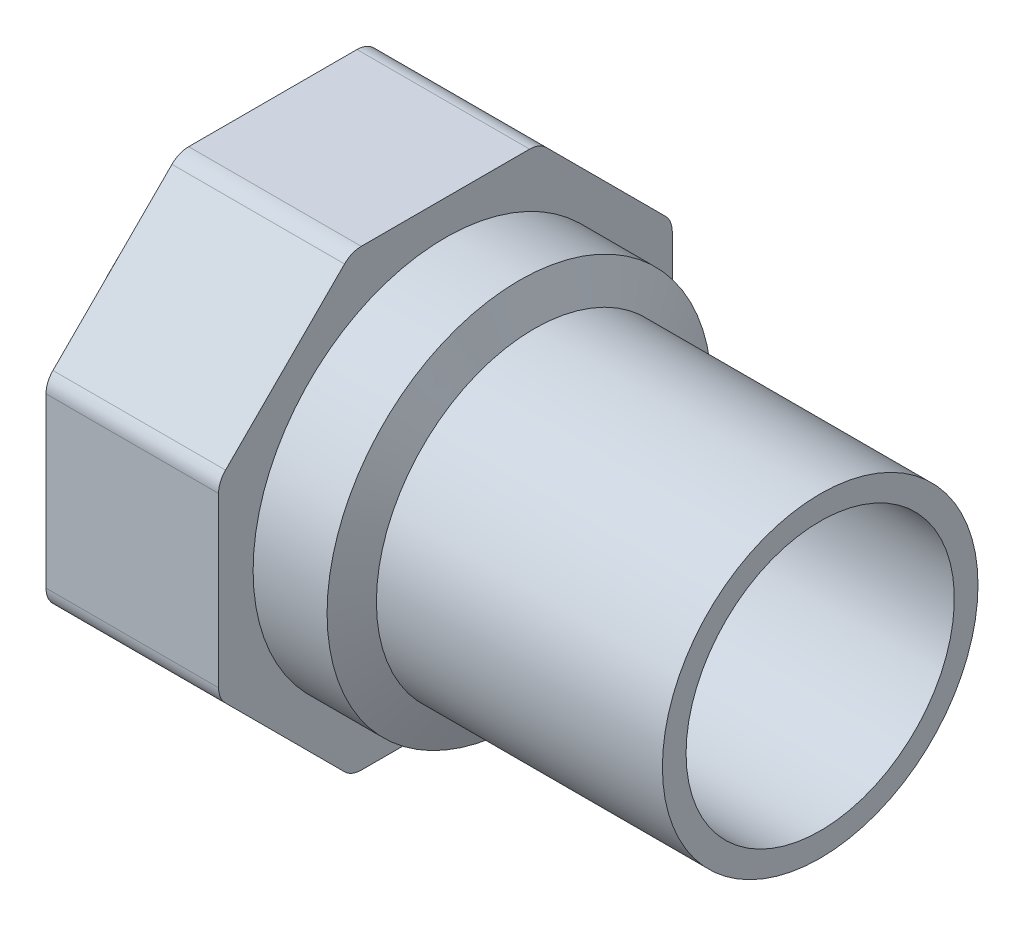
ISO-10303-21;
HEADER;
FILE_DESCRIPTION(('STEP AP214'),'2;1');
FILE_NAME('part.step','',(''),(''),'','','');
FILE_SCHEMA(('AUTOMOTIVE_DESIGN { 1 0 10303 214 1 1 1 1 }'));
ENDSEC;
DATA;
#1=APPLICATION_CONTEXT('core data for automotive mechanical design processes');
#2=APPLICATION_PROTOCOL_DEFINITION('international standard','automotive_design',2000,#1);
#3=PRODUCT_CONTEXT('',#1,'mechanical');
#4=PRODUCT('Part','Part','',(#3));
#5=PRODUCT_RELATED_PRODUCT_CATEGORY('part','',(#4));
#6=PRODUCT_DEFINITION_FORMATION('','',#4);
#7=PRODUCT_DEFINITION_CONTEXT('part definition',#1,'design');
#8=PRODUCT_DEFINITION('design','',#6,#7);
#9=PRODUCT_DEFINITION_SHAPE('','',#8);
#10=(LENGTH_UNIT() NAMED_UNIT(*) SI_UNIT(.MILLI.,.METRE.));
#11=(NAMED_UNIT(*) PLANE_ANGLE_UNIT() SI_UNIT($,.RADIAN.));
#12=(NAMED_UNIT(*) SI_UNIT($,.STERADIAN.) SOLID_ANGLE_UNIT());
#13=UNCERTAINTY_MEASURE_WITH_UNIT(LENGTH_MEASURE(1.E-05),#10,'distance_accuracy_value','');
#14=(GEOMETRIC_REPRESENTATION_CONTEXT(3) GLOBAL_UNCERTAINTY_ASSIGNED_CONTEXT((#13)) GLOBAL_UNIT_ASSIGNED_CONTEXT((#10,
#11,#12)) REPRESENTATION_CONTEXT('',''));
#15=CARTESIAN_POINT('',(0.,0.,0.));
#16=DIRECTION('',(0.,0.,1.));
#17=DIRECTION('',(1.,0.,0.));
#18=AXIS2_PLACEMENT_3D('',#15,#16,#17);
#19=CARTESIAN_POINT('',(-29.,0.,0.));
#20=DIRECTION('',(-1.,0.,0.));
#21=DIRECTION('',(0.,0.,1.));
#22=AXIS2_PLACEMENT_3D('',#19,#20,#21);
#23=CYLINDRICAL_SURFACE('',#22,16.);
#24=CARTESIAN_POINT('',(-29.,0.,0.));
#25=DIRECTION('',(1.,0.,0.));
#26=DIRECTION('',(0.,1.,0.));
#27=AXIS2_PLACEMENT_3D('',#24,#25,#26);
#28=CIRCLE('',#27,16.);
#29=CARTESIAN_POINT('',(-29.,16.,0.));
#30=VERTEX_POINT('',#29);
#31=EDGE_CURVE('E193',#30,#30,#28,.F.);
#32=ORIENTED_EDGE('',*,*,#31,.F.);
#33=EDGE_LOOP('',(#32));
#34=FACE_BOUND('',#33,.T.);
#35=CARTESIAN_POINT('',(0.,0.,0.));
#36=DIRECTION('',(-1.,0.,0.));
#37=DIRECTION('',(0.,0.,1.));
#38=AXIS2_PLACEMENT_3D('',#35,#36,#37);
#39=CIRCLE('',#38,16.);
#40=CARTESIAN_POINT('',(0.,0.,16.));
#41=VERTEX_POINT('',#40);
#42=EDGE_CURVE('E18',#41,#41,#39,.F.);
#43=ORIENTED_EDGE('',*,*,#42,.F.);
#44=EDGE_LOOP('',(#43));
#45=FACE_BOUND('',#44,.T.);
#46=ADVANCED_FACE('F15',(#34,#45),#23,.T.);
#47=CARTESIAN_POINT('',(-29.,0.,0.));
#48=DIRECTION('',(-1.,0.,0.));
#49=DIRECTION('',(0.,0.,1.));
#50=AXIS2_PLACEMENT_3D('',#47,#48,#49);
#51=CONICAL_SURFACE('',#50,16.,1.16590454050981);
#52=CARTESIAN_POINT('',(-30.5,0.,0.));
#53=DIRECTION('',(-1.,0.,0.));
#54=DIRECTION('',(0.,1.,0.));
#55=AXIS2_PLACEMENT_3D('',#52,#53,#54);
#56=CIRCLE('',#55,19.5);
#57=CARTESIAN_POINT('',(-30.5,19.5,0.));
#58=VERTEX_POINT('',#57);
#59=EDGE_CURVE('E189',#58,#58,#56,.T.);
#60=ORIENTED_EDGE('',*,*,#59,.F.);
#61=EDGE_LOOP('',(#60));
#62=FACE_BOUND('',#61,.T.);
#63=ORIENTED_EDGE('',*,*,#31,.T.);
#64=EDGE_LOOP('',(#63));
#65=FACE_BOUND('',#64,.T.);
#66=ADVANCED_FACE('F268',(#62,#65),#51,.T.);
#67=CARTESIAN_POINT('',(0.,16.,16.1920021082986));
#68=DIRECTION('',(1.,0.,0.));
#69=DIRECTION('',(0.,-1.,0.));
#70=AXIS2_PLACEMENT_3D('',#67,#68,#69);
#71=PLANE('',#70);
#72=CARTESIAN_POINT('',(0.,0.,0.));
#73=DIRECTION('',(-1.,0.,0.));
#74=DIRECTION('',(0.,0.,1.));
#75=AXIS2_PLACEMENT_3D('',#72,#73,#74);
#76=CIRCLE('',#75,13.6);
#77=CARTESIAN_POINT('',(0.,0.,13.6));
#78=VERTEX_POINT('',#77);
#79=EDGE_CURVE('E192',#78,#78,#76,.F.);
#80=ORIENTED_EDGE('',*,*,#79,.F.);
#81=EDGE_LOOP('',(#80));
#82=FACE_BOUND('',#81,.T.);
#83=ORIENTED_EDGE('',*,*,#42,.T.);
#84=EDGE_LOOP('',(#83));
#85=FACE_BOUND('',#84,.T.);
#86=ADVANCED_FACE('F264',(#82,#85),#71,.T.);
#87=CARTESIAN_POINT('',(-38.,0.,0.));
#88=DIRECTION('',(-1.,0.,0.));
#89=DIRECTION('',(0.,0.,1.));
#90=AXIS2_PLACEMENT_3D('',#87,#88,#89);
#91=CYLINDRICAL_SURFACE('',#90,19.5);
#92=CARTESIAN_POINT('',(-38.,0.,0.));
#93=DIRECTION('',(-1.,0.,0.));
#94=DIRECTION('',(0.,0.,1.));
#95=AXIS2_PLACEMENT_3D('',#92,#93,#94);
#96=CIRCLE('',#95,19.5);
#97=CARTESIAN_POINT('',(-38.,0.,19.5));
#98=VERTEX_POINT('',#97);
#99=EDGE_CURVE('E188',#98,#98,#96,.T.);
#100=ORIENTED_EDGE('',*,*,#99,.F.);
#101=EDGE_LOOP('',(#100));
#102=FACE_BOUND('',#101,.T.);
#103=ORIENTED_EDGE('',*,*,#59,.T.);
#104=EDGE_LOOP('',(#103));
#105=FACE_BOUND('',#104,.T.);
#106=ADVANCED_FACE('F267',(#102,#105),#91,.T.);
#107=CARTESIAN_POINT('',(0.,0.,0.));
#108=DIRECTION('',(-1.,0.,0.));
#109=DIRECTION('',(0.,0.,1.));
#110=AXIS2_PLACEMENT_3D('',#107,#108,#109);
#111=CYLINDRICAL_SURFACE('',#110,13.6);
#112=ORIENTED_EDGE('',*,*,#79,.T.);
#113=EDGE_LOOP('',(#112));
#114=FACE_BOUND('',#113,.T.);
#115=CARTESIAN_POINT('',(-37.7775828648937,0.,0.));
#116=DIRECTION('',(1.,0.,0.));
#117=DIRECTION('',(0.,1.,0.));
#118=AXIS2_PLACEMENT_3D('',#115,#116,#117);
#119=CIRCLE('',#118,13.6);
#120=CARTESIAN_POINT('',(-37.7775828648937,13.6,0.));
#121=VERTEX_POINT('',#120);
#122=EDGE_CURVE('E135',#121,#121,#119,.T.);
#123=ORIENTED_EDGE('',*,*,#122,.F.);
#124=EDGE_LOOP('',(#123));
#125=FACE_BOUND('',#124,.T.);
#126=ADVANCED_FACE('F261',(#114,#125),#111,.F.);
#127=CARTESIAN_POINT('',(-38.,23.,23.));
#128=DIRECTION('',(1.,0.,0.));
#129=DIRECTION('',(0.,-1.,0.));
#130=AXIS2_PLACEMENT_3D('',#127,#128,#129);
#131=PLANE('',#130);
#132=ORIENTED_EDGE('',*,*,#99,.T.);
#133=EDGE_LOOP('',(#132));
#134=FACE_BOUND('',#133,.T.);
#135=CARTESIAN_POINT('',(-38.,8.53279938488576,20.6));
#136=DIRECTION('',(1.,0.,0.));
#137=DIRECTION('',(0.,0.,-1.));
#138=AXIS2_PLACEMENT_3D('',#135,#136,#137);
#139=CIRCLE('',#138,2.39999999999998);
#140=CARTESIAN_POINT('',(-38.,8.53279938488576,23.));
#141=VERTEX_POINT('',#140);
#142=CARTESIAN_POINT('',(-38.,10.2298556597335,22.2970562748477));
#143=VERTEX_POINT('',#142);
#144=EDGE_CURVE('E254',#141,#143,#139,.F.);
#145=ORIENTED_EDGE('',*,*,#144,.F.);
#146=DIRECTION('',(0.,1.,0.));
#147=VECTOR('',#146,1.);
#148=CARTESIAN_POINT('',(-38.,0.,23.));
#149=LINE('',#148,#147);
#150=CARTESIAN_POINT('',(-38.,-8.53279938488579,23.));
#151=VERTEX_POINT('',#150);
#152=EDGE_CURVE('E132',#151,#141,#149,.T.);
#153=ORIENTED_EDGE('',*,*,#152,.F.);
#154=CARTESIAN_POINT('',(-38.,-8.5327993848858,20.6));
#155=DIRECTION('',(1.,0.,0.));
#156=DIRECTION('',(0.,0.,-1.));
#157=AXIS2_PLACEMENT_3D('',#154,#155,#156);
#158=CIRCLE('',#157,2.39999999999996);
#159=CARTESIAN_POINT('',(-38.,-10.2298556597335,22.2970562748477));
#160=VERTEX_POINT('',#159);
#161=EDGE_CURVE('E126',#160,#151,#158,.F.);
#162=ORIENTED_EDGE('',*,*,#161,.F.);
#163=DIRECTION('',(0.,0.707106781186547,0.707106781186548));
#164=VECTOR('',#163,1.);
#165=CARTESIAN_POINT('',(-38.,-16.2634559672906,16.2634559672906));
#166=LINE('',#165,#164);
#167=CARTESIAN_POINT('',(-38.,-22.2970562748477,10.2298556597335));
#168=VERTEX_POINT('',#167);
#169=EDGE_CURVE('E130',#168,#160,#166,.T.);
#170=ORIENTED_EDGE('',*,*,#169,.F.);
#171=CARTESIAN_POINT('',(-38.,-20.6,8.53279938488576));
#172=DIRECTION('',(1.,0.,0.));
#173=DIRECTION('',(0.,0.,-1.));
#174=AXIS2_PLACEMENT_3D('',#171,#172,#173);
#175=CIRCLE('',#174,2.39999999999998);
#176=CARTESIAN_POINT('',(-38.,-23.,8.53279938488576));
#177=VERTEX_POINT('',#176);
#178=EDGE_CURVE('E149',#177,#168,#175,.F.);
#179=ORIENTED_EDGE('',*,*,#178,.F.);
#180=DIRECTION('',(0.,0.,1.));
#181=VECTOR('',#180,1.);
#182=CARTESIAN_POINT('',(-38.,-23.,0.));
#183=LINE('',#182,#181);
#184=CARTESIAN_POINT('',(-38.,-23.,-8.53279938488577));
#185=VERTEX_POINT('',#184);
#186=EDGE_CURVE('E154',#185,#177,#183,.T.);
#187=ORIENTED_EDGE('',*,*,#186,.F.);
#188=CARTESIAN_POINT('',(-38.,-20.6,-8.53279938488577));
#189=DIRECTION('',(1.,0.,0.));
#190=DIRECTION('',(0.,0.,-1.));
#191=AXIS2_PLACEMENT_3D('',#188,#189,#190);
#192=CIRCLE('',#191,2.39999999999998);
#193=CARTESIAN_POINT('',(-38.,-22.2970562748477,-10.2298556597335));
#194=VERTEX_POINT('',#193);
#195=EDGE_CURVE('E239',#194,#185,#192,.F.);
#196=ORIENTED_EDGE('',*,*,#195,.F.);
#197=DIRECTION('',(0.,-0.707106781186548,0.707106781186547));
#198=VECTOR('',#197,1.);
#199=CARTESIAN_POINT('',(-38.,-16.2634559672906,-16.2634559672906));
#200=LINE('',#199,#198);
#201=CARTESIAN_POINT('',(-38.,-10.2298556597335,-22.2970562748477));
#202=VERTEX_POINT('',#201);
#203=EDGE_CURVE('E159',#202,#194,#200,.T.);
#204=ORIENTED_EDGE('',*,*,#203,.F.);
#205=CARTESIAN_POINT('',(-38.,-8.53279938488576,-20.6));
#206=DIRECTION('',(1.,0.,0.));
#207=DIRECTION('',(0.,0.,-1.));
#208=AXIS2_PLACEMENT_3D('',#205,#206,#207);
#209=CIRCLE('',#208,2.39999999999998);
#210=CARTESIAN_POINT('',(-38.,-8.53279938488575,-23.));
#211=VERTEX_POINT('',#210);
#212=EDGE_CURVE('E242',#211,#202,#209,.F.);
#213=ORIENTED_EDGE('',*,*,#212,.F.);
#214=DIRECTION('',(0.,-1.,0.));
#215=VECTOR('',#214,1.);
#216=CARTESIAN_POINT('',(-38.,0.,-23.));
#217=LINE('',#216,#215);
#218=CARTESIAN_POINT('',(-38.,8.53279938488578,-23.));
#219=VERTEX_POINT('',#218);
#220=EDGE_CURVE('E164',#219,#211,#217,.T.);
#221=ORIENTED_EDGE('',*,*,#220,.F.);
#222=CARTESIAN_POINT('',(-38.,8.53279938488578,-20.6));
#223=DIRECTION('',(1.,0.,0.));
#224=DIRECTION('',(0.,0.,-1.));
#225=AXIS2_PLACEMENT_3D('',#222,#223,#224);
#226=CIRCLE('',#225,2.39999999999996);
#227=CARTESIAN_POINT('',(-38.,10.2298556597335,-22.2970562748477));
#228=VERTEX_POINT('',#227);
#229=EDGE_CURVE('E245',#228,#219,#226,.F.);
#230=ORIENTED_EDGE('',*,*,#229,.F.);
#231=DIRECTION('',(0.,-0.707106781186547,-0.707106781186547));
#232=VECTOR('',#231,1.);
#233=CARTESIAN_POINT('',(-38.,16.2634559672906,-16.2634559672906));
#234=LINE('',#233,#232);
#235=CARTESIAN_POINT('',(-38.,22.2970562748477,-10.2298556597335));
#236=VERTEX_POINT('',#235);
#237=EDGE_CURVE('E169',#236,#228,#234,.T.);
#238=ORIENTED_EDGE('',*,*,#237,.F.);
#239=CARTESIAN_POINT('',(-38.,20.6,-8.53279938488577));
#240=DIRECTION('',(1.,0.,0.));
#241=DIRECTION('',(0.,0.,-1.));
#242=AXIS2_PLACEMENT_3D('',#239,#240,#241);
#243=CIRCLE('',#242,2.39999999999997);
#244=CARTESIAN_POINT('',(-38.,23.,-8.53279938488576));
#245=VERTEX_POINT('',#244);
#246=EDGE_CURVE('E248',#245,#236,#243,.F.);
#247=ORIENTED_EDGE('',*,*,#246,.F.);
#248=DIRECTION('',(0.,0.,-1.));
#249=VECTOR('',#248,1.);
#250=CARTESIAN_POINT('',(-38.,23.,0.));
#251=LINE('',#250,#249);
#252=CARTESIAN_POINT('',(-38.,23.,8.53279938488576));
#253=VERTEX_POINT('',#252);
#254=EDGE_CURVE('E174',#253,#245,#251,.T.);
#255=ORIENTED_EDGE('',*,*,#254,.F.);
#256=CARTESIAN_POINT('',(-38.,20.6,8.53279938488576));
#257=DIRECTION('',(1.,0.,0.));
#258=DIRECTION('',(0.,0.,-1.));
#259=AXIS2_PLACEMENT_3D('',#256,#257,#258);
#260=CIRCLE('',#259,2.4);
#261=CARTESIAN_POINT('',(-38.,22.2970562748477,10.2298556597335));
#262=VERTEX_POINT('',#261);
#263=EDGE_CURVE('E251',#262,#253,#260,.F.);
#264=ORIENTED_EDGE('',*,*,#263,.F.);
#265=DIRECTION('',(0.,0.707106781186547,-0.707106781186547));
#266=VECTOR('',#265,1.);
#267=CARTESIAN_POINT('',(-38.,16.2634559672906,16.2634559672906));
#268=LINE('',#267,#266);
#269=EDGE_CURVE('E179',#143,#262,#268,.T.);
#270=ORIENTED_EDGE('',*,*,#269,.F.);
#271=EDGE_LOOP('',(#145,#153,#162,#170,#179,#187,#196,#204,#213,#221,#230,#238,#247,#255,#264,#270));
#272=FACE_BOUND('',#271,.T.);
#273=ADVANCED_FACE('F128',(#134,#272),#131,.T.);
#274=CARTESIAN_POINT('',(-38.,0.,0.));
#275=DIRECTION('',(-1.,0.,0.));
#276=DIRECTION('',(0.,0.,1.));
#277=AXIS2_PLACEMENT_3D('',#274,#275,#276);
#278=CONICAL_SURFACE('',#277,13.9852377784781,1.0471975511966);
#279=ORIENTED_EDGE('',*,*,#122,.T.);
#280=EDGE_LOOP('',(#279));
#281=FACE_BOUND('',#280,.T.);
#282=CARTESIAN_POINT('',(-38.,0.,0.));
#283=DIRECTION('',(1.,0.,0.));
#284=DIRECTION('',(0.,1.,0.));
#285=AXIS2_PLACEMENT_3D('',#282,#283,#284);
#286=CIRCLE('',#285,13.9852377784781);
#287=CARTESIAN_POINT('',(-38.,13.9852377784781,0.));
#288=VERTEX_POINT('',#287);
#289=EDGE_CURVE('E153',#288,#288,#286,.T.);
#290=ORIENTED_EDGE('',*,*,#289,.F.);
#291=EDGE_LOOP('',(#290));
#292=FACE_BOUND('',#291,.T.);
#293=ADVANCED_FACE('F438',(#281,#292),#278,.F.);
#294=CARTESIAN_POINT('',(-38.,-8.5327993848858,20.6));
#295=DIRECTION('',(1.,0.,0.));
#296=DIRECTION('',(0.,0.,-1.));
#297=AXIS2_PLACEMENT_3D('',#294,#295,#296);
#298=CYLINDRICAL_SURFACE('',#297,2.39999999999996);
#299=CARTESIAN_POINT('',(-55.5,-8.5327993848858,20.6));
#300=DIRECTION('',(1.,0.,0.));
#301=DIRECTION('',(0.,0.,-1.));
#302=AXIS2_PLACEMENT_3D('',#299,#300,#301);
#303=CIRCLE('',#302,2.39999999999996);
#304=CARTESIAN_POINT('',(-55.5,-10.2298556597335,22.2970562748477));
#305=VERTEX_POINT('',#304);
#306=CARTESIAN_POINT('',(-55.5,-8.53279938488579,23.));
#307=VERTEX_POINT('',#306);
#308=EDGE_CURVE('E141',#305,#307,#303,.F.);
#309=ORIENTED_EDGE('',*,*,#308,.F.);
#310=DIRECTION('',(1.,0.,0.));
#311=VECTOR('',#310,1.);
#312=CARTESIAN_POINT('',(-55.5,-10.2298556597335,22.2970562748477));
#313=LINE('',#312,#311);
#314=EDGE_CURVE('E138',#160,#305,#313,.F.);
#315=ORIENTED_EDGE('',*,*,#314,.F.);
#316=ORIENTED_EDGE('',*,*,#161,.T.);
#317=DIRECTION('',(1.,0.,0.));
#318=VECTOR('',#317,1.);
#319=CARTESIAN_POINT('',(-55.5,-8.53279938488578,23.));
#320=LINE('',#319,#318);
#321=EDGE_CURVE('E185',#307,#151,#320,.T.);
#322=ORIENTED_EDGE('',*,*,#321,.F.);
#323=EDGE_LOOP('',(#309,#315,#316,#322));
#324=FACE_BOUND('',#323,.T.);
#325=ADVANCED_FACE('F139',(#324),#298,.T.);
#326=CARTESIAN_POINT('',(-55.5,8.53279938488575,23.));
#327=DIRECTION('',(0.,0.,1.));
#328=DIRECTION('',(0.,-1.,0.));
#329=AXIS2_PLACEMENT_3D('',#326,#327,#328);
#330=PLANE('',#329);
#331=DIRECTION('',(0.,1.,0.));
#332=VECTOR('',#331,1.);
#333=CARTESIAN_POINT('',(-55.5,0.,23.));
#334=LINE('',#333,#332);
#335=CARTESIAN_POINT('',(-55.5,8.53279938488576,23.));
#336=VERTEX_POINT('',#335);
#337=EDGE_CURVE('E236',#307,#336,#334,.T.);
#338=ORIENTED_EDGE('',*,*,#337,.F.);
#339=ORIENTED_EDGE('',*,*,#321,.T.);
#340=ORIENTED_EDGE('',*,*,#152,.T.);
#341=DIRECTION('',(1.,0.,0.));
#342=VECTOR('',#341,1.);
#343=CARTESIAN_POINT('',(-46.75,8.53279938488575,23.));
#344=LINE('',#343,#342);
#345=EDGE_CURVE('E183',#336,#141,#344,.T.);
#346=ORIENTED_EDGE('',*,*,#345,.F.);
#347=EDGE_LOOP('',(#338,#339,#340,#346));
#348=FACE_BOUND('',#347,.T.);
#349=ADVANCED_FACE('F387',(#348),#330,.T.);
#350=CARTESIAN_POINT('',(-38.,8.53279938488576,20.6));
#351=DIRECTION('',(1.,0.,0.));
#352=DIRECTION('',(0.,0.,-1.));
#353=AXIS2_PLACEMENT_3D('',#350,#351,#352);
#354=CYLINDRICAL_SURFACE('',#353,2.39999999999998);
#355=CARTESIAN_POINT('',(-55.5,8.53279938488576,20.6));
#356=DIRECTION('',(1.,0.,0.));
#357=DIRECTION('',(0.,0.,-1.));
#358=AXIS2_PLACEMENT_3D('',#355,#356,#357);
#359=CIRCLE('',#358,2.39999999999998);
#360=CARTESIAN_POINT('',(-55.5,10.2298556597335,22.2970562748477));
#361=VERTEX_POINT('',#360);
#362=EDGE_CURVE('E233',#336,#361,#359,.F.);
#363=ORIENTED_EDGE('',*,*,#362,.F.);
#364=ORIENTED_EDGE('',*,*,#345,.T.);
#365=ORIENTED_EDGE('',*,*,#144,.T.);
#366=DIRECTION('',(1.,0.,0.));
#367=VECTOR('',#366,1.);
#368=CARTESIAN_POINT('',(-55.5,10.2298556597335,22.2970562748477));
#369=LINE('',#368,#367);
#370=EDGE_CURVE('E182',#361,#143,#369,.T.);
#371=ORIENTED_EDGE('',*,*,#370,.F.);
#372=EDGE_LOOP('',(#363,#364,#365,#371));
#373=FACE_BOUND('',#372,.T.);
#374=ADVANCED_FACE('F425',(#373),#354,.T.);
#375=CARTESIAN_POINT('',(-55.5,22.2970562748477,10.2298556597335));
#376=DIRECTION('',(0.,0.707106781186548,0.707106781186547));
#377=DIRECTION('',(0.,-0.707106781186547,0.707106781186548));
#378=AXIS2_PLACEMENT_3D('',#375,#376,#377);
#379=PLANE('',#378);
#380=CARTESIAN_POINT('',(-55.5,10.2298556597335,22.2970562748477));
#381=CARTESIAN_POINT('',(-55.5,10.7326556853632,21.7942562492179));
#382=CARTESIAN_POINT('',(-55.5,11.235455710993,21.2914562235882));
#383=CARTESIAN_POINT('',(-55.5,12.2410557622525,20.2858561723287));
#384=CARTESIAN_POINT('',(-55.5,12.7438557878823,19.7830561466989));
#385=CARTESIAN_POINT('',(-55.5,13.7494558391418,18.7774560954394));
#386=CARTESIAN_POINT('',(-55.5,14.2522558647716,18.2746560698096));
#387=CARTESIAN_POINT('',(-55.5,15.2578559160311,17.2690560185501));
#388=CARTESIAN_POINT('',(-55.5,15.7606559416608,16.7662559929203));
#389=CARTESIAN_POINT('',(-55.5,16.7662559929203,15.7606559416608));
#390=CARTESIAN_POINT('',(-55.5,17.2690560185501,15.2578559160311));
#391=CARTESIAN_POINT('',(-55.5,18.2746560698096,14.2522558647715));
#392=CARTESIAN_POINT('',(-55.5,18.7774560954394,13.7494558391418));
#393=CARTESIAN_POINT('',(-55.5,19.7830561466989,12.7438557878823));
#394=CARTESIAN_POINT('',(-55.5,20.2858561723287,12.2410557622525));
#395=CARTESIAN_POINT('',(-55.5,21.2914562235882,11.235455710993));
#396=CARTESIAN_POINT('',(-55.5,21.7942562492179,10.7326556853632));
#397=CARTESIAN_POINT('',(-55.5,22.2970562748477,10.2298556597335));
#398=B_SPLINE_CURVE_WITH_KNOTS('',3,(#380,#381,#382,#383,#384,#385,#386,#387,#388,#389,#390,
#391,#392,#393,#394,#395,#396,#397),.UNSPECIFIED.,.F.,.F.,(4,2,2,2,2,2,2,2,4),(0.,
2.13319984622144,4.26639969244288,6.39959953866432,8.53279938488575,10.6659992311072,
12.7991990773286,14.9323989235501,17.0655987697715),.UNSPECIFIED.);
#399=CARTESIAN_POINT('',(-55.5,22.2970562748477,10.2298556597335));
#400=VERTEX_POINT('',#399);
#401=EDGE_CURVE('E232',#361,#400,#398,.T.);
#402=ORIENTED_EDGE('',*,*,#401,.F.);
#403=ORIENTED_EDGE('',*,*,#370,.T.);
#404=ORIENTED_EDGE('',*,*,#269,.T.);
#405=DIRECTION('',(1.,0.,0.));
#406=VECTOR('',#405,1.);
#407=CARTESIAN_POINT('',(-46.75,22.2970562748477,10.2298556597335));
#408=LINE('',#407,#406);
#409=EDGE_CURVE('E178',#400,#262,#408,.T.);
#410=ORIENTED_EDGE('',*,*,#409,.F.);
#411=EDGE_LOOP('',(#402,#403,#404,#410));
#412=FACE_BOUND('',#411,.T.);
#413=ADVANCED_FACE('F423',(#412),#379,.T.);
#414=CARTESIAN_POINT('',(-38.,20.6,8.53279938488576));
#415=DIRECTION('',(1.,0.,0.));
#416=DIRECTION('',(0.,0.,-1.));
#417=AXIS2_PLACEMENT_3D('',#414,#415,#416);
#418=CYLINDRICAL_SURFACE('',#417,2.4);
#419=CARTESIAN_POINT('',(-55.5,20.6,8.53279938488576));
#420=DIRECTION('',(1.,0.,0.));
#421=DIRECTION('',(0.,0.,-1.));
#422=AXIS2_PLACEMENT_3D('',#419,#420,#421);
#423=CIRCLE('',#422,2.4);
#424=CARTESIAN_POINT('',(-55.5,23.,8.53279938488576));
#425=VERTEX_POINT('',#424);
#426=EDGE_CURVE('E229',#400,#425,#423,.F.);
#427=ORIENTED_EDGE('',*,*,#426,.F.);
#428=ORIENTED_EDGE('',*,*,#409,.T.);
#429=ORIENTED_EDGE('',*,*,#263,.T.);
#430=DIRECTION('',(1.,0.,0.));
#431=VECTOR('',#430,1.);
#432=CARTESIAN_POINT('',(-55.5,23.,8.53279938488576));
#433=LINE('',#432,#431);
#434=EDGE_CURVE('E177',#425,#253,#433,.T.);
#435=ORIENTED_EDGE('',*,*,#434,.F.);
#436=EDGE_LOOP('',(#427,#428,#429,#435));
#437=FACE_BOUND('',#436,.T.);
#438=ADVANCED_FACE('F420',(#437),#418,.T.);
#439=CARTESIAN_POINT('',(-55.5,23.,-8.53279938488575));
#440=DIRECTION('',(0.,1.,0.));
#441=DIRECTION('',(0.,0.,1.));
#442=AXIS2_PLACEMENT_3D('',#439,#440,#441);
#443=PLANE('',#442);
#444=DIRECTION('',(0.,0.,-1.));
#445=VECTOR('',#444,1.);
#446=CARTESIAN_POINT('',(-55.5,23.,23.));
#447=LINE('',#446,#445);
#448=CARTESIAN_POINT('',(-55.5,23.,-8.53279938488576));
#449=VERTEX_POINT('',#448);
#450=EDGE_CURVE('E228',#425,#449,#447,.T.);
#451=ORIENTED_EDGE('',*,*,#450,.F.);
#452=ORIENTED_EDGE('',*,*,#434,.T.);
#453=ORIENTED_EDGE('',*,*,#254,.T.);
#454=DIRECTION('',(1.,0.,0.));
#455=VECTOR('',#454,1.);
#456=CARTESIAN_POINT('',(-46.75,23.,-8.53279938488575));
#457=LINE('',#456,#455);
#458=EDGE_CURVE('E173',#449,#245,#457,.T.);
#459=ORIENTED_EDGE('',*,*,#458,.F.);
#460=EDGE_LOOP('',(#451,#452,#453,#459));
#461=FACE_BOUND('',#460,.T.);
#462=ADVANCED_FACE('F417',(#461),#443,.T.);
#463=CARTESIAN_POINT('',(-38.,20.6,-8.53279938488577));
#464=DIRECTION('',(1.,0.,0.));
#465=DIRECTION('',(0.,0.,-1.));
#466=AXIS2_PLACEMENT_3D('',#463,#464,#465);
#467=CYLINDRICAL_SURFACE('',#466,2.39999999999997);
#468=CARTESIAN_POINT('',(-55.5,20.6,-8.53279938488577));
#469=DIRECTION('',(1.,0.,0.));
#470=DIRECTION('',(0.,0.,-1.));
#471=AXIS2_PLACEMENT_3D('',#468,#469,#470);
#472=CIRCLE('',#471,2.39999999999997);
#473=CARTESIAN_POINT('',(-55.5,22.2970562748477,-10.2298556597335));
#474=VERTEX_POINT('',#473);
#475=EDGE_CURVE('E225',#449,#474,#472,.F.);
#476=ORIENTED_EDGE('',*,*,#475,.F.);
#477=ORIENTED_EDGE('',*,*,#458,.T.);
#478=ORIENTED_EDGE('',*,*,#246,.T.);
#479=DIRECTION('',(1.,0.,0.));
#480=VECTOR('',#479,1.);
#481=CARTESIAN_POINT('',(-55.5,22.2970562748477,-10.2298556597335));
#482=LINE('',#481,#480);
#483=EDGE_CURVE('E172',#474,#236,#482,.T.);
#484=ORIENTED_EDGE('',*,*,#483,.F.);
#485=EDGE_LOOP('',(#476,#477,#478,#484));
#486=FACE_BOUND('',#485,.T.);
#487=ADVANCED_FACE('F414',(#486),#467,.T.);
#488=CARTESIAN_POINT('',(-55.5,10.2298556597335,-22.2970562748477));
#489=DIRECTION('',(0.,0.707106781186547,-0.707106781186547));
#490=DIRECTION('',(0.,0.707106781186547,0.707106781186547));
#491=AXIS2_PLACEMENT_3D('',#488,#489,#490);
#492=PLANE('',#491);
#493=CARTESIAN_POINT('',(-55.5,22.2970562748477,-10.2298556597335));
#494=CARTESIAN_POINT('',(-55.5,21.794256249218,-10.7326556853632));
#495=CARTESIAN_POINT('',(-55.5,21.2914562235882,-11.235455710993));
#496=CARTESIAN_POINT('',(-55.5,20.2858561723287,-12.2410557622525));
#497=CARTESIAN_POINT('',(-55.5,19.7830561466989,-12.7438557878823));
#498=CARTESIAN_POINT('',(-55.5,18.7774560954394,-13.7494558391418));
#499=CARTESIAN_POINT('',(-55.5,18.2746560698096,-14.2522558647715));
#500=CARTESIAN_POINT('',(-55.5,17.2690560185501,-15.2578559160311));
#501=CARTESIAN_POINT('',(-55.5,16.7662559929204,-15.7606559416608));
#502=CARTESIAN_POINT('',(-55.5,15.7606559416608,-16.7662559929203));
#503=CARTESIAN_POINT('',(-55.5,15.2578559160311,-17.2690560185501));
#504=CARTESIAN_POINT('',(-55.5,14.2522558647716,-18.2746560698096));
#505=CARTESIAN_POINT('',(-55.5,13.7494558391418,-18.7774560954394));
#506=CARTESIAN_POINT('',(-55.5,12.7438557878823,-19.7830561466989));
#507=CARTESIAN_POINT('',(-55.5,12.2410557622525,-20.2858561723287));
#508=CARTESIAN_POINT('',(-55.5,11.235455710993,-21.2914562235882));
#509=CARTESIAN_POINT('',(-55.5,10.7326556853632,-21.794256249218));
#510=CARTESIAN_POINT('',(-55.5,10.2298556597335,-22.2970562748477));
#511=B_SPLINE_CURVE_WITH_KNOTS('',3,(#493,#494,#495,#496,#497,#498,#499,#500,#501,#502,#503,
#504,#505,#506,#507,#508,#509,#510),.UNSPECIFIED.,.F.,.F.,(4,2,2,2,2,2,2,2,4),(0.,
2.13319984622144,4.26639969244288,6.39959953866432,8.53279938488576,10.6659992311072,
12.7991990773286,14.9323989235501,17.0655987697715),.UNSPECIFIED.);
#512=CARTESIAN_POINT('',(-55.5,10.2298556597335,-22.2970562748477));
#513=VERTEX_POINT('',#512);
#514=EDGE_CURVE('E224',#474,#513,#511,.T.);
#515=ORIENTED_EDGE('',*,*,#514,.F.);
#516=ORIENTED_EDGE('',*,*,#483,.T.);
#517=ORIENTED_EDGE('',*,*,#237,.T.);
#518=DIRECTION('',(1.,0.,0.));
#519=VECTOR('',#518,1.);
#520=CARTESIAN_POINT('',(-46.75,10.2298556597335,-22.2970562748477));
#521=LINE('',#520,#519);
#522=EDGE_CURVE('E168',#513,#228,#521,.T.);
#523=ORIENTED_EDGE('',*,*,#522,.F.);
#524=EDGE_LOOP('',(#515,#516,#517,#523));
#525=FACE_BOUND('',#524,.T.);
#526=ADVANCED_FACE('F411',(#525),#492,.T.);
#527=CARTESIAN_POINT('',(-38.,8.53279938488578,-20.6));
#528=DIRECTION('',(1.,0.,0.));
#529=DIRECTION('',(0.,0.,-1.));
#530=AXIS2_PLACEMENT_3D('',#527,#528,#529);
#531=CYLINDRICAL_SURFACE('',#530,2.39999999999996);
#532=CARTESIAN_POINT('',(-55.5,8.53279938488578,-20.6));
#533=DIRECTION('',(1.,0.,0.));
#534=DIRECTION('',(0.,0.,-1.));
#535=AXIS2_PLACEMENT_3D('',#532,#533,#534);
#536=CIRCLE('',#535,2.39999999999996);
#537=CARTESIAN_POINT('',(-55.5,8.53279938488578,-23.));
#538=VERTEX_POINT('',#537);
#539=EDGE_CURVE('E221',#513,#538,#536,.F.);
#540=ORIENTED_EDGE('',*,*,#539,.F.);
#541=ORIENTED_EDGE('',*,*,#522,.T.);
#542=ORIENTED_EDGE('',*,*,#229,.T.);
#543=DIRECTION('',(1.,0.,0.));
#544=VECTOR('',#543,1.);
#545=CARTESIAN_POINT('',(-55.5,8.53279938488577,-23.));
#546=LINE('',#545,#544);
#547=EDGE_CURVE('E167',#538,#219,#546,.T.);
#548=ORIENTED_EDGE('',*,*,#547,.F.);
#549=EDGE_LOOP('',(#540,#541,#542,#548));
#550=FACE_BOUND('',#549,.T.);
#551=ADVANCED_FACE('F408',(#550),#531,.T.);
#552=CARTESIAN_POINT('',(-55.5,-8.53279938488575,-23.));
#553=DIRECTION('',(0.,0.,-1.));
#554=DIRECTION('',(0.,1.,0.));
#555=AXIS2_PLACEMENT_3D('',#552,#553,#554);
#556=PLANE('',#555);
#557=DIRECTION('',(0.,-1.,0.));
#558=VECTOR('',#557,1.);
#559=CARTESIAN_POINT('',(-55.5,0.,-23.));
#560=LINE('',#559,#558);
#561=CARTESIAN_POINT('',(-55.5,-8.53279938488576,-23.));
#562=VERTEX_POINT('',#561);
#563=EDGE_CURVE('E220',#538,#562,#560,.T.);
#564=ORIENTED_EDGE('',*,*,#563,.F.);
#565=ORIENTED_EDGE('',*,*,#547,.T.);
#566=ORIENTED_EDGE('',*,*,#220,.T.);
#567=DIRECTION('',(1.,0.,0.));
#568=VECTOR('',#567,1.);
#569=CARTESIAN_POINT('',(-46.75,-8.53279938488575,-23.));
#570=LINE('',#569,#568);
#571=EDGE_CURVE('E163',#562,#211,#570,.T.);
#572=ORIENTED_EDGE('',*,*,#571,.F.);
#573=EDGE_LOOP('',(#564,#565,#566,#572));
#574=FACE_BOUND('',#573,.T.);
#575=ADVANCED_FACE('F405',(#574),#556,.T.);
#576=CARTESIAN_POINT('',(-38.,-8.53279938488576,-20.6));
#577=DIRECTION('',(1.,0.,0.));
#578=DIRECTION('',(0.,0.,-1.));
#579=AXIS2_PLACEMENT_3D('',#576,#577,#578);
#580=CYLINDRICAL_SURFACE('',#579,2.39999999999998);
#581=CARTESIAN_POINT('',(-55.5,-8.53279938488576,-20.6));
#582=DIRECTION('',(1.,0.,0.));
#583=DIRECTION('',(0.,0.,-1.));
#584=AXIS2_PLACEMENT_3D('',#581,#582,#583);
#585=CIRCLE('',#584,2.39999999999998);
#586=CARTESIAN_POINT('',(-55.5,-10.2298556597335,-22.2970562748477));
#587=VERTEX_POINT('',#586);
#588=EDGE_CURVE('E217',#562,#587,#585,.F.);
#589=ORIENTED_EDGE('',*,*,#588,.F.);
#590=ORIENTED_EDGE('',*,*,#571,.T.);
#591=ORIENTED_EDGE('',*,*,#212,.T.);
#592=DIRECTION('',(1.,0.,0.));
#593=VECTOR('',#592,1.);
#594=CARTESIAN_POINT('',(-55.5,-10.2298556597335,-22.2970562748477));
#595=LINE('',#594,#593);
#596=EDGE_CURVE('E162',#587,#202,#595,.T.);
#597=ORIENTED_EDGE('',*,*,#596,.F.);
#598=EDGE_LOOP('',(#589,#590,#591,#597));
#599=FACE_BOUND('',#598,.T.);
#600=ADVANCED_FACE('F402',(#599),#580,.T.);
#601=CARTESIAN_POINT('',(-55.5,-22.2970562748477,-10.2298556597335));
#602=DIRECTION('',(0.,-0.707106781186547,-0.707106781186548));
#603=DIRECTION('',(0.,0.707106781186548,-0.707106781186547));
#604=AXIS2_PLACEMENT_3D('',#601,#602,#603);
#605=PLANE('',#604);
#606=CARTESIAN_POINT('',(-55.5,-10.2298556597335,-22.2970562748477));
#607=CARTESIAN_POINT('',(-55.5,-10.7326556853632,-21.794256249218));
#608=CARTESIAN_POINT('',(-55.5,-11.235455710993,-21.2914562235882));
#609=CARTESIAN_POINT('',(-55.5,-12.2410557622525,-20.2858561723287));
#610=CARTESIAN_POINT('',(-55.5,-12.7438557878823,-19.7830561466989));
#611=CARTESIAN_POINT('',(-55.5,-13.7494558391418,-18.7774560954394));
#612=CARTESIAN_POINT('',(-55.5,-14.2522558647716,-18.2746560698096));
#613=CARTESIAN_POINT('',(-55.5,-15.2578559160311,-17.2690560185501));
#614=CARTESIAN_POINT('',(-55.5,-15.7606559416608,-16.7662559929204));
#615=CARTESIAN_POINT('',(-55.5,-16.7662559929204,-15.7606559416608));
#616=CARTESIAN_POINT('',(-55.5,-17.2690560185501,-15.2578559160311));
#617=CARTESIAN_POINT('',(-55.5,-18.2746560698096,-14.2522558647716));
#618=CARTESIAN_POINT('',(-55.5,-18.7774560954394,-13.7494558391418));
#619=CARTESIAN_POINT('',(-55.5,-19.7830561466989,-12.7438557878823));
#620=CARTESIAN_POINT('',(-55.5,-20.2858561723287,-12.2410557622525));
#621=CARTESIAN_POINT('',(-55.5,-21.2914562235882,-11.235455710993));
#622=CARTESIAN_POINT('',(-55.5,-21.794256249218,-10.7326556853632));
#623=CARTESIAN_POINT('',(-55.5,-22.2970562748477,-10.2298556597335));
#624=B_SPLINE_CURVE_WITH_KNOTS('',3,(#606,#607,#608,#609,#610,#611,#612,#613,#614,#615,#616,
#617,#618,#619,#620,#621,#622,#623),.UNSPECIFIED.,.F.,.F.,(4,2,2,2,2,2,2,2,4),(0.,
2.13319984622144,4.26639969244288,6.39959953866432,8.53279938488576,10.6659992311072,
12.7991990773286,14.9323989235501,17.0655987697715),.UNSPECIFIED.);
#625=CARTESIAN_POINT('',(-55.5,-22.2970562748477,-10.2298556597335));
#626=VERTEX_POINT('',#625);
#627=EDGE_CURVE('E216',#587,#626,#624,.T.);
#628=ORIENTED_EDGE('',*,*,#627,.F.);
#629=ORIENTED_EDGE('',*,*,#596,.T.);
#630=ORIENTED_EDGE('',*,*,#203,.T.);
#631=DIRECTION('',(1.,0.,0.));
#632=VECTOR('',#631,1.);
#633=CARTESIAN_POINT('',(-46.75,-22.2970562748477,-10.2298556597335));
#634=LINE('',#633,#632);
#635=EDGE_CURVE('E158',#626,#194,#634,.T.);
#636=ORIENTED_EDGE('',*,*,#635,.F.);
#637=EDGE_LOOP('',(#628,#629,#630,#636));
#638=FACE_BOUND('',#637,.T.);
#639=ADVANCED_FACE('F399',(#638),#605,.T.);
#640=CARTESIAN_POINT('',(-38.,-20.6,-8.53279938488577));
#641=DIRECTION('',(1.,0.,0.));
#642=DIRECTION('',(0.,0.,-1.));
#643=AXIS2_PLACEMENT_3D('',#640,#641,#642);
#644=CYLINDRICAL_SURFACE('',#643,2.39999999999998);
#645=CARTESIAN_POINT('',(-55.5,-20.6,-8.53279938488577));
#646=DIRECTION('',(1.,0.,0.));
#647=DIRECTION('',(0.,0.,-1.));
#648=AXIS2_PLACEMENT_3D('',#645,#646,#647);
#649=CIRCLE('',#648,2.39999999999998);
#650=CARTESIAN_POINT('',(-55.5,-23.,-8.53279938488576));
#651=VERTEX_POINT('',#650);
#652=EDGE_CURVE('E213',#626,#651,#649,.F.);
#653=ORIENTED_EDGE('',*,*,#652,.F.);
#654=ORIENTED_EDGE('',*,*,#635,.T.);
#655=ORIENTED_EDGE('',*,*,#195,.T.);
#656=DIRECTION('',(1.,0.,0.));
#657=VECTOR('',#656,1.);
#658=CARTESIAN_POINT('',(-55.5,-23.,-8.53279938488576));
#659=LINE('',#658,#657);
#660=EDGE_CURVE('E157',#651,#185,#659,.T.);
#661=ORIENTED_EDGE('',*,*,#660,.F.);
#662=EDGE_LOOP('',(#653,#654,#655,#661));
#663=FACE_BOUND('',#662,.T.);
#664=ADVANCED_FACE('F396',(#663),#644,.T.);
#665=CARTESIAN_POINT('',(-55.5,-23.,8.53279938488575));
#666=DIRECTION('',(0.,-1.,0.));
#667=DIRECTION('',(0.,0.,-1.));
#668=AXIS2_PLACEMENT_3D('',#665,#666,#667);
#669=PLANE('',#668);
#670=DIRECTION('',(0.,0.,-1.));
#671=VECTOR('',#670,1.);
#672=CARTESIAN_POINT('',(-55.5,-23.,23.));
#673=LINE('',#672,#671);
#674=CARTESIAN_POINT('',(-55.5,-23.,8.53279938488576));
#675=VERTEX_POINT('',#674);
#676=EDGE_CURVE('E212',#651,#675,#673,.F.);
#677=ORIENTED_EDGE('',*,*,#676,.F.);
#678=ORIENTED_EDGE('',*,*,#660,.T.);
#679=ORIENTED_EDGE('',*,*,#186,.T.);
#680=DIRECTION('',(1.,0.,0.));
#681=VECTOR('',#680,1.);
#682=CARTESIAN_POINT('',(-46.75,-23.,8.53279938488575));
#683=LINE('',#682,#681);
#684=EDGE_CURVE('E146',#675,#177,#683,.T.);
#685=ORIENTED_EDGE('',*,*,#684,.F.);
#686=EDGE_LOOP('',(#677,#678,#679,#685));
#687=FACE_BOUND('',#686,.T.);
#688=ADVANCED_FACE('F393',(#687),#669,.T.);
#689=CARTESIAN_POINT('',(-38.,-20.6,8.53279938488576));
#690=DIRECTION('',(1.,0.,0.));
#691=DIRECTION('',(0.,0.,-1.));
#692=AXIS2_PLACEMENT_3D('',#689,#690,#691);
#693=CYLINDRICAL_SURFACE('',#692,2.39999999999998);
#694=CARTESIAN_POINT('',(-55.5,-20.6,8.53279938488576));
#695=DIRECTION('',(1.,0.,0.));
#696=DIRECTION('',(0.,0.,-1.));
#697=AXIS2_PLACEMENT_3D('',#694,#695,#696);
#698=CIRCLE('',#697,2.39999999999998);
#699=CARTESIAN_POINT('',(-55.5,-22.2970562748477,10.2298556597335));
#700=VERTEX_POINT('',#699);
#701=EDGE_CURVE('E208',#675,#700,#698,.F.);
#702=ORIENTED_EDGE('',*,*,#701,.F.);
#703=ORIENTED_EDGE('',*,*,#684,.T.);
#704=ORIENTED_EDGE('',*,*,#178,.T.);
#705=DIRECTION('',(1.,0.,0.));
#706=VECTOR('',#705,1.);
#707=CARTESIAN_POINT('',(-55.5,-22.2970562748477,10.2298556597335));
#708=LINE('',#707,#706);
#709=EDGE_CURVE('E33',#700,#168,#708,.T.);
#710=ORIENTED_EDGE('',*,*,#709,.F.);
#711=EDGE_LOOP('',(#702,#703,#704,#710));
#712=FACE_BOUND('',#711,.T.);
#713=ADVANCED_FACE('F391',(#712),#693,.T.);
#714=CARTESIAN_POINT('',(-55.5,-10.2298556597335,22.2970562748477));
#715=DIRECTION('',(0.,-0.707106781186548,0.707106781186547));
#716=DIRECTION('',(0.,-0.707106781186547,-0.707106781186548));
#717=AXIS2_PLACEMENT_3D('',#714,#715,#716);
#718=PLANE('',#717);
#719=CARTESIAN_POINT('',(-55.5,-22.2970562748477,10.2298556597335));
#720=CARTESIAN_POINT('',(-55.5,-21.794256249218,10.7326556853632));
#721=CARTESIAN_POINT('',(-55.5,-21.2914562235882,11.235455710993));
#722=CARTESIAN_POINT('',(-55.5,-20.2858561723287,12.2410557622525));
#723=CARTESIAN_POINT('',(-55.5,-19.7830561466989,12.7438557878823));
#724=CARTESIAN_POINT('',(-55.5,-18.7774560954394,13.7494558391418));
#725=CARTESIAN_POINT('',(-55.5,-18.2746560698097,14.2522558647716));
#726=CARTESIAN_POINT('',(-55.5,-17.2690560185501,15.2578559160311));
#727=CARTESIAN_POINT('',(-55.5,-16.7662559929204,15.7606559416608));
#728=CARTESIAN_POINT('',(-55.5,-15.7606559416609,16.7662559929203));
#729=CARTESIAN_POINT('',(-55.5,-15.2578559160311,17.2690560185501));
#730=CARTESIAN_POINT('',(-55.5,-14.2522558647716,18.2746560698096));
#731=CARTESIAN_POINT('',(-55.5,-13.7494558391418,18.7774560954394));
#732=CARTESIAN_POINT('',(-55.5,-12.7438557878823,19.7830561466989));
#733=CARTESIAN_POINT('',(-55.5,-12.2410557622525,20.2858561723287));
#734=CARTESIAN_POINT('',(-55.5,-11.235455710993,21.2914562235882));
#735=CARTESIAN_POINT('',(-55.5,-10.7326556853633,21.7942562492179));
#736=CARTESIAN_POINT('',(-55.5,-10.2298556597335,22.2970562748477));
#737=B_SPLINE_CURVE_WITH_KNOTS('',3,(#719,#720,#721,#722,#723,#724,#725,#726,#727,#728,#729,
#730,#731,#732,#733,#734,#735,#736),.UNSPECIFIED.,.F.,.F.,(4,2,2,2,2,2,2,2,4),(0.,
2.13319984622144,4.26639969244287,6.39959953866431,8.53279938488575,10.6659992311072,
12.7991990773286,14.9323989235501,17.0655987697715),.UNSPECIFIED.);
#738=EDGE_CURVE('E211',#700,#305,#737,.T.);
#739=ORIENTED_EDGE('',*,*,#738,.F.);
#740=ORIENTED_EDGE('',*,*,#709,.T.);
#741=ORIENTED_EDGE('',*,*,#169,.T.);
#742=ORIENTED_EDGE('',*,*,#314,.T.);
#743=EDGE_LOOP('',(#739,#740,#741,#742));
#744=FACE_BOUND('',#743,.T.);
#745=ADVANCED_FACE('F145',(#744),#718,.T.);
#746=CARTESIAN_POINT('',(-53.673130898859,0.,0.));
#747=DIRECTION('',(-1.,0.,0.));
#748=DIRECTION('',(0.,0.,1.));
#749=AXIS2_PLACEMENT_3D('',#746,#747,#748);
#750=CONICAL_SURFACE('',#749,14.473130898859,0.031119220563059);
#751=ORIENTED_EDGE('',*,*,#289,.T.);
#752=EDGE_LOOP('',(#751));
#753=FACE_BOUND('',#752,.T.);
#754=CARTESIAN_POINT('',(-53.673130898859,0.,0.));
#755=DIRECTION('',(1.,0.,0.));
#756=DIRECTION('',(0.,1.,0.));
#757=AXIS2_PLACEMENT_3D('',#754,#755,#756);
#758=CIRCLE('',#757,14.473130898859);
#759=CARTESIAN_POINT('',(-53.673130898859,14.473130898859,0.));
#760=VERTEX_POINT('',#759);
#761=EDGE_CURVE('E207',#760,#760,#758,.T.);
#762=ORIENTED_EDGE('',*,*,#761,.F.);
#763=EDGE_LOOP('',(#762));
#764=FACE_BOUND('',#763,.T.);
#765=ADVANCED_FACE('F560',(#753,#764),#750,.F.);
#766=CARTESIAN_POINT('',(-55.5,-23.,23.));
#767=DIRECTION('',(-1.,0.,0.));
#768=DIRECTION('',(0.,1.,0.));
#769=AXIS2_PLACEMENT_3D('',#766,#767,#768);
#770=PLANE('',#769);
#771=CARTESIAN_POINT('',(-55.5,0.,0.));
#772=DIRECTION('',(-1.,0.,0.));
#773=DIRECTION('',(0.,0.,1.));
#774=AXIS2_PLACEMENT_3D('',#771,#772,#773);
#775=CIRCLE('',#774,19.5);
#776=CARTESIAN_POINT('',(-55.5,0.,19.5));
#777=VERTEX_POINT('',#776);
#778=EDGE_CURVE('E204',#777,#777,#775,.T.);
#779=ORIENTED_EDGE('',*,*,#778,.F.);
#780=EDGE_LOOP('',(#779));
#781=FACE_BOUND('',#780,.T.);
#782=ORIENTED_EDGE('',*,*,#701,.T.);
#783=ORIENTED_EDGE('',*,*,#738,.T.);
#784=ORIENTED_EDGE('',*,*,#308,.T.);
#785=ORIENTED_EDGE('',*,*,#337,.T.);
#786=ORIENTED_EDGE('',*,*,#362,.T.);
#787=ORIENTED_EDGE('',*,*,#401,.T.);
#788=ORIENTED_EDGE('',*,*,#426,.T.);
#789=ORIENTED_EDGE('',*,*,#450,.T.);
#790=ORIENTED_EDGE('',*,*,#475,.T.);
#791=ORIENTED_EDGE('',*,*,#514,.T.);
#792=ORIENTED_EDGE('',*,*,#539,.T.);
#793=ORIENTED_EDGE('',*,*,#563,.T.);
#794=ORIENTED_EDGE('',*,*,#588,.T.);
#795=ORIENTED_EDGE('',*,*,#627,.T.);
#796=ORIENTED_EDGE('',*,*,#652,.T.);
#797=ORIENTED_EDGE('',*,*,#676,.T.);
#798=EDGE_LOOP('',(#782,#783,#784,#785,#786,#787,#788,#789,#790,#791,#792,#793,#794,#795,#796,#797));
#799=FACE_BOUND('',#798,.T.);
#800=ADVANCED_FACE('F304',(#781,#799),#770,.T.);
#801=CARTESIAN_POINT('',(-55.5,0.,0.));
#802=DIRECTION('',(-1.,0.,0.));
#803=DIRECTION('',(0.,0.,1.));
#804=AXIS2_PLACEMENT_3D('',#801,#802,#803);
#805=CONICAL_SURFACE('',#804,16.3,0.785398163397451);
#806=ORIENTED_EDGE('',*,*,#761,.T.);
#807=EDGE_LOOP('',(#806));
#808=FACE_BOUND('',#807,.T.);
#809=CARTESIAN_POINT('',(-55.5,0.,0.));
#810=DIRECTION('',(-1.,0.,0.));
#811=DIRECTION('',(0.,0.,1.));
#812=AXIS2_PLACEMENT_3D('',#809,#810,#811);
#813=CIRCLE('',#812,16.3);
#814=CARTESIAN_POINT('',(-55.5,0.,16.3));
#815=VERTEX_POINT('',#814);
#816=EDGE_CURVE('E201',#815,#815,#813,.F.);
#817=ORIENTED_EDGE('',*,*,#816,.F.);
#818=EDGE_LOOP('',(#817));
#819=FACE_BOUND('',#818,.T.);
#820=ADVANCED_FACE('F300',(#808,#819),#805,.F.);
#821=CARTESIAN_POINT('',(-58.,0.,0.));
#822=DIRECTION('',(-1.,0.,0.));
#823=DIRECTION('',(0.,0.,1.));
#824=AXIS2_PLACEMENT_3D('',#821,#822,#823);
#825=CYLINDRICAL_SURFACE('',#824,19.5);
#826=CARTESIAN_POINT('',(-58.,0.,0.));
#827=DIRECTION('',(-1.,0.,0.));
#828=DIRECTION('',(0.,0.,1.));
#829=AXIS2_PLACEMENT_3D('',#826,#827,#828);
#830=CIRCLE('',#829,19.5);
#831=CARTESIAN_POINT('',(-58.,0.,19.5));
#832=VERTEX_POINT('',#831);
#833=EDGE_CURVE('E198',#832,#832,#830,.T.);
#834=ORIENTED_EDGE('',*,*,#833,.F.);
#835=EDGE_LOOP('',(#834));
#836=FACE_BOUND('',#835,.T.);
#837=ORIENTED_EDGE('',*,*,#778,.T.);
#838=EDGE_LOOP('',(#837));
#839=FACE_BOUND('',#838,.T.);
#840=ADVANCED_FACE('F296',(#836,#839),#825,.T.);
#841=CARTESIAN_POINT('',(-55.5,-17.9,18.1148021083727));
#842=DIRECTION('',(-1.,0.,0.));
#843=DIRECTION('',(0.,1.,0.));
#844=AXIS2_PLACEMENT_3D('',#841,#842,#843);
#845=PLANE('',#844);
#846=ORIENTED_EDGE('',*,*,#816,.T.);
#847=EDGE_LOOP('',(#846));
#848=FACE_BOUND('',#847,.T.);
#849=CARTESIAN_POINT('',(-55.5,0.,0.));
#850=DIRECTION('',(-1.,0.,0.));
#851=DIRECTION('',(0.,0.,1.));
#852=AXIS2_PLACEMENT_3D('',#849,#850,#851);
#853=CIRCLE('',#852,17.9);
#854=CARTESIAN_POINT('',(-55.5,0.,17.9));
#855=VERTEX_POINT('',#854);
#856=EDGE_CURVE('E24',#855,#855,#853,.F.);
#857=ORIENTED_EDGE('',*,*,#856,.F.);
#858=EDGE_LOOP('',(#857));
#859=FACE_BOUND('',#858,.T.);
#860=ADVANCED_FACE('F289',(#848,#859),#845,.T.);
#861=CARTESIAN_POINT('',(-58.,-19.5,19.7340021083201));
#862=DIRECTION('',(-1.,0.,0.));
#863=DIRECTION('',(0.,1.,0.));
#864=AXIS2_PLACEMENT_3D('',#861,#862,#863);
#865=PLANE('',#864);
#866=CARTESIAN_POINT('',(-58.,0.,0.));
#867=DIRECTION('',(-1.,0.,0.));
#868=DIRECTION('',(0.,0.,1.));
#869=AXIS2_PLACEMENT_3D('',#866,#867,#868);
#870=CIRCLE('',#869,17.9);
#871=CARTESIAN_POINT('',(-58.,0.,17.9));
#872=VERTEX_POINT('',#871);
#873=EDGE_CURVE('E9',#872,#872,#870,.T.);
#874=ORIENTED_EDGE('',*,*,#873,.F.);
#875=EDGE_LOOP('',(#874));
#876=FACE_BOUND('',#875,.T.);
#877=ORIENTED_EDGE('',*,*,#833,.T.);
#878=EDGE_LOOP('',(#877));
#879=FACE_BOUND('',#878,.T.);
#880=ADVANCED_FACE('F283',(#876,#879),#865,.T.);
#881=CARTESIAN_POINT('',(-55.5,0.,0.));
#882=DIRECTION('',(-1.,0.,0.));
#883=DIRECTION('',(0.,0.,1.));
#884=AXIS2_PLACEMENT_3D('',#881,#882,#883);
#885=CYLINDRICAL_SURFACE('',#884,17.9);
#886=ORIENTED_EDGE('',*,*,#856,.T.);
#887=EDGE_LOOP('',(#886));
#888=FACE_BOUND('',#887,.T.);
#889=ORIENTED_EDGE('',*,*,#873,.T.);
#890=EDGE_LOOP('',(#889));
#891=FACE_BOUND('',#890,.T.);
#892=ADVANCED_FACE('F281',(#888,#891),#885,.F.);
#893=CLOSED_SHELL('',(#46,#66,#86,#106,#126,#273,#293,#325,#349,#374,#413,#438,#462,#487,#526,
#551,#575,#600,#639,#664,#688,#713,#745,#765,#800,#820,#840,#860,#880,#892));
#894=MANIFOLD_SOLID_BREP('B1',#893);
#895=ADVANCED_BREP_SHAPE_REPRESENTATION('',(#18,#894),#14);
#896=SHAPE_DEFINITION_REPRESENTATION(#9,#895);
ENDSEC;
END-ISO-10303-21;
